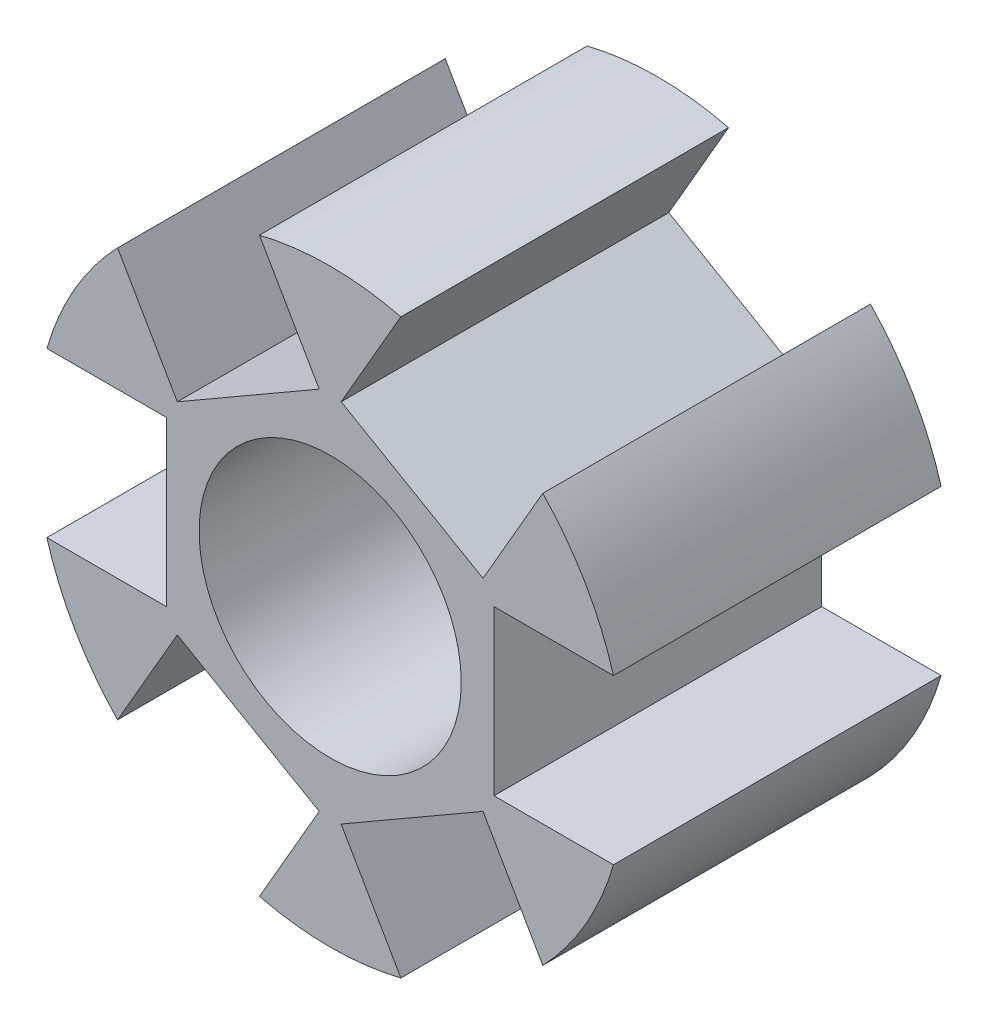
ISO-10303-21;
HEADER;
FILE_DESCRIPTION(('STEP AP214'),'2;1');
FILE_NAME('part.step','',(''),(''),'','','');
FILE_SCHEMA(('AUTOMOTIVE_DESIGN { 1 0 10303 214 1 1 1 1 }'));
ENDSEC;
DATA;
#1=APPLICATION_CONTEXT('core data for automotive mechanical design processes');
#2=APPLICATION_PROTOCOL_DEFINITION('international standard','automotive_design',2000,#1);
#3=PRODUCT_CONTEXT('',#1,'mechanical');
#4=PRODUCT('Part','Part','',(#3));
#5=PRODUCT_RELATED_PRODUCT_CATEGORY('part','',(#4));
#6=PRODUCT_DEFINITION_FORMATION('','',#4);
#7=PRODUCT_DEFINITION_CONTEXT('part definition',#1,'design');
#8=PRODUCT_DEFINITION('design','',#6,#7);
#9=PRODUCT_DEFINITION_SHAPE('','',#8);
#10=(LENGTH_UNIT() NAMED_UNIT(*) SI_UNIT(.MILLI.,.METRE.));
#11=(NAMED_UNIT(*) PLANE_ANGLE_UNIT() SI_UNIT($,.RADIAN.));
#12=(NAMED_UNIT(*) SI_UNIT($,.STERADIAN.) SOLID_ANGLE_UNIT());
#13=UNCERTAINTY_MEASURE_WITH_UNIT(LENGTH_MEASURE(1.E-05),#10,'distance_accuracy_value','');
#14=(GEOMETRIC_REPRESENTATION_CONTEXT(3) GLOBAL_UNCERTAINTY_ASSIGNED_CONTEXT((#13)) GLOBAL_UNIT_ASSIGNED_CONTEXT((#10,
#11,#12)) REPRESENTATION_CONTEXT('',''));
#15=CARTESIAN_POINT('',(0.,0.,0.));
#16=DIRECTION('',(0.,0.,1.));
#17=DIRECTION('',(1.,0.,0.));
#18=AXIS2_PLACEMENT_3D('',#15,#16,#17);
#19=CARTESIAN_POINT('',(0.,0.,5.));
#20=DIRECTION('',(0.,0.,1.));
#21=DIRECTION('',(1.,0.,0.));
#22=AXIS2_PLACEMENT_3D('',#19,#20,#21);
#23=PLANE('',#22);
#24=CARTESIAN_POINT('',(0.,0.,5.));
#25=DIRECTION('',(0.,0.,1.));
#26=DIRECTION('',(1.,0.,0.));
#27=AXIS2_PLACEMENT_3D('',#24,#25,#26);
#28=CIRCLE('',#27,4.);
#29=CARTESIAN_POINT('',(4.,0.,5.));
#30=VERTEX_POINT('',#29);
#31=EDGE_CURVE('E337',#30,#30,#28,.T.);
#32=ORIENTED_EDGE('',*,*,#31,.F.);
#33=EDGE_LOOP('',(#32));
#34=FACE_BOUND('',#33,.T.);
#35=DIRECTION('',(-0.866025403784433,-0.50000000000001,0.));
#36=VECTOR('',#35,1.);
#37=CARTESIAN_POINT('',(-0.334936490538965,5.58012701892219,5.));
#38=LINE('',#37,#36);
#39=CARTESIAN_POINT('',(-0.334936490538965,5.58012701892219,5.));
#40=VERTEX_POINT('',#39);
#41=CARTESIAN_POINT('',(-4.66506350946113,3.08012701892214,5.));
#42=VERTEX_POINT('',#41);
#43=EDGE_CURVE('E283',#40,#42,#38,.T.);
#44=ORIENTED_EDGE('',*,*,#43,.T.);
#45=DIRECTION('',(-0.50000000000001,0.866025403784433,0.));
#46=VECTOR('',#45,1.);
#47=CARTESIAN_POINT('',(-4.66506350946113,3.08012701892214,5.));
#48=LINE('',#47,#46);
#49=CARTESIAN_POINT('',(-6.48796762590881,6.23748956593589,5.));
#50=VERTEX_POINT('',#49);
#51=EDGE_CURVE('E287',#42,#50,#48,.T.);
#52=ORIENTED_EDGE('',*,*,#51,.T.);
#53=CARTESIAN_POINT('',(0.,0.,5.));
#54=DIRECTION('',(0.,0.,1.));
#55=DIRECTION('',(1.,0.,0.));
#56=AXIS2_PLACEMENT_3D('',#53,#54,#55);
#57=CIRCLE('',#56,9.);
#58=CARTESIAN_POINT('',(-8.64580823289529,2.5,5.));
#59=VERTEX_POINT('',#58);
#60=EDGE_CURVE('E350',#50,#59,#57,.T.);
#61=ORIENTED_EDGE('',*,*,#60,.T.);
#62=DIRECTION('',(-1.,0.,0.));
#63=VECTOR('',#62,1.);
#64=CARTESIAN_POINT('',(-5.,2.5,5.));
#65=LINE('',#64,#63);
#66=CARTESIAN_POINT('',(-5.,2.5,5.));
#67=VERTEX_POINT('',#66);
#68=EDGE_CURVE('E330',#67,#59,#65,.T.);
#69=ORIENTED_EDGE('',*,*,#68,.F.);
#70=DIRECTION('',(0.,-1.,0.));
#71=VECTOR('',#70,1.);
#72=CARTESIAN_POINT('',(-5.,2.5,5.));
#73=LINE('',#72,#71);
#74=CARTESIAN_POINT('',(-5.,-2.5,5.));
#75=VERTEX_POINT('',#74);
#76=EDGE_CURVE('E321',#67,#75,#73,.T.);
#77=ORIENTED_EDGE('',*,*,#76,.T.);
#78=DIRECTION('',(-1.,0.,0.));
#79=VECTOR('',#78,1.);
#80=CARTESIAN_POINT('',(-5.,-2.5,5.));
#81=LINE('',#80,#79);
#82=CARTESIAN_POINT('',(-8.64580823289529,-2.5,5.));
#83=VERTEX_POINT('',#82);
#84=EDGE_CURVE('E323',#75,#83,#81,.T.);
#85=ORIENTED_EDGE('',*,*,#84,.T.);
#86=CARTESIAN_POINT('',(-6.48796762590873,-6.23748956593598,5.));
#87=VERTEX_POINT('',#86);
#88=EDGE_CURVE('E342',#83,#87,#57,.T.);
#89=ORIENTED_EDGE('',*,*,#88,.T.);
#90=DIRECTION('',(-0.499999999999998,-0.86602540378444,0.));
#91=VECTOR('',#90,1.);
#92=CARTESIAN_POINT('',(-4.66506350946109,-3.0801270189222,5.));
#93=LINE('',#92,#91);
#94=CARTESIAN_POINT('',(-4.66506350946109,-3.0801270189222,5.));
#95=VERTEX_POINT('',#94);
#96=EDGE_CURVE('E306',#95,#87,#93,.T.);
#97=ORIENTED_EDGE('',*,*,#96,.F.);
#98=DIRECTION('',(0.86602540378444,-0.499999999999998,0.));
#99=VECTOR('',#98,1.);
#100=CARTESIAN_POINT('',(-4.66506350946109,-3.0801270189222,5.));
#101=LINE('',#100,#99);
#102=CARTESIAN_POINT('',(-0.334936490538889,-5.58012701892219,5.));
#103=VERTEX_POINT('',#102);
#104=EDGE_CURVE('E297',#95,#103,#101,.T.);
#105=ORIENTED_EDGE('',*,*,#104,.T.);
#106=DIRECTION('',(-0.499999999999998,-0.86602540378444,0.));
#107=VECTOR('',#106,1.);
#108=CARTESIAN_POINT('',(-0.334936490538889,-5.58012701892219,5.));
#109=LINE('',#108,#107);
#110=CARTESIAN_POINT('',(-2.15784060698653,-8.73748956593597,5.));
#111=VERTEX_POINT('',#110);
#112=EDGE_CURVE('E303',#103,#111,#109,.T.);
#113=ORIENTED_EDGE('',*,*,#112,.T.);
#114=CARTESIAN_POINT('',(2.15784060698659,-8.73748956593596,5.));
#115=VERTEX_POINT('',#114);
#116=EDGE_CURVE('E347',#111,#115,#57,.T.);
#117=ORIENTED_EDGE('',*,*,#116,.T.);
#118=DIRECTION('',(0.500000000000004,-0.866025403784436,0.));
#119=VECTOR('',#118,1.);
#120=CARTESIAN_POINT('',(0.334936490538926,-5.58012701892219,5.));
#121=LINE('',#120,#119);
#122=CARTESIAN_POINT('',(0.334936490538926,-5.58012701892219,5.));
#123=VERTEX_POINT('',#122);
#124=EDGE_CURVE('E231',#123,#115,#121,.T.);
#125=ORIENTED_EDGE('',*,*,#124,.F.);
#126=DIRECTION('',(0.866025403784436,0.500000000000004,0.));
#127=VECTOR('',#126,1.);
#128=CARTESIAN_POINT('',(0.334936490538926,-5.58012701892219,5.));
#129=LINE('',#128,#127);
#130=CARTESIAN_POINT('',(4.66506350946111,-3.08012701892217,5.));
#131=VERTEX_POINT('',#130);
#132=EDGE_CURVE('E516',#123,#131,#129,.T.);
#133=ORIENTED_EDGE('',*,*,#132,.T.);
#134=DIRECTION('',(0.500000000000004,-0.866025403784436,0.));
#135=VECTOR('',#134,1.);
#136=CARTESIAN_POINT('',(4.66506350946111,-3.08012701892217,5.));
#137=LINE('',#136,#135);
#138=CARTESIAN_POINT('',(6.48796762590877,-6.23748956593594,5.));
#139=VERTEX_POINT('',#138);
#140=EDGE_CURVE('E219',#131,#139,#137,.T.);
#141=ORIENTED_EDGE('',*,*,#140,.T.);
#142=CARTESIAN_POINT('',(8.64580823289529,-2.5,5.));
#143=VERTEX_POINT('',#142);
#144=EDGE_CURVE('E430',#139,#143,#57,.T.);
#145=ORIENTED_EDGE('',*,*,#144,.T.);
#146=DIRECTION('',(1.,0.,0.));
#147=VECTOR('',#146,1.);
#148=CARTESIAN_POINT('',(5.,-2.5,5.));
#149=LINE('',#148,#147);
#150=CARTESIAN_POINT('',(5.,-2.5,5.));
#151=VERTEX_POINT('',#150);
#152=EDGE_CURVE('E255',#151,#143,#149,.T.);
#153=ORIENTED_EDGE('',*,*,#152,.F.);
#154=DIRECTION('',(0.,1.,0.));
#155=VECTOR('',#154,1.);
#156=CARTESIAN_POINT('',(5.,-2.5,5.));
#157=LINE('',#156,#155);
#158=CARTESIAN_POINT('',(5.,2.5,5.));
#159=VERTEX_POINT('',#158);
#160=EDGE_CURVE('E246',#151,#159,#157,.T.);
#161=ORIENTED_EDGE('',*,*,#160,.T.);
#162=DIRECTION('',(1.,0.,0.));
#163=VECTOR('',#162,1.);
#164=CARTESIAN_POINT('',(5.,2.5,5.));
#165=LINE('',#164,#163);
#166=CARTESIAN_POINT('',(8.64580823289529,2.5,5.));
#167=VERTEX_POINT('',#166);
#168=EDGE_CURVE('E248',#159,#167,#165,.T.);
#169=ORIENTED_EDGE('',*,*,#168,.T.);
#170=CARTESIAN_POINT('',(6.48796762590869,6.23748956593603,5.));
#171=VERTEX_POINT('',#170);
#172=EDGE_CURVE('E429',#167,#171,#57,.T.);
#173=ORIENTED_EDGE('',*,*,#172,.T.);
#174=DIRECTION('',(0.499999999999992,0.866025403784443,0.));
#175=VECTOR('',#174,1.);
#176=CARTESIAN_POINT('',(4.66506350946107,3.08012701892223,5.));
#177=LINE('',#176,#175);
#178=CARTESIAN_POINT('',(4.66506350946107,3.08012701892223,5.));
#179=VERTEX_POINT('',#178);
#180=EDGE_CURVE('E63',#179,#171,#177,.T.);
#181=ORIENTED_EDGE('',*,*,#180,.F.);
#182=DIRECTION('',(-0.866025403784443,0.499999999999992,0.));
#183=VECTOR('',#182,1.);
#184=CARTESIAN_POINT('',(4.66506350946107,3.08012701892223,5.));
#185=LINE('',#184,#183);
#186=CARTESIAN_POINT('',(0.33493649053885,5.58012701892219,5.));
#187=VERTEX_POINT('',#186);
#188=EDGE_CURVE('E266',#179,#187,#185,.T.);
#189=ORIENTED_EDGE('',*,*,#188,.T.);
#190=DIRECTION('',(0.499999999999992,0.866025403784443,0.));
#191=VECTOR('',#190,1.);
#192=CARTESIAN_POINT('',(0.33493649053885,5.58012701892219,5.));
#193=LINE('',#192,#191);
#194=CARTESIAN_POINT('',(2.15784060698647,8.73748956593599,5.));
#195=VERTEX_POINT('',#194);
#196=EDGE_CURVE('E268',#187,#195,#193,.T.);
#197=ORIENTED_EDGE('',*,*,#196,.T.);
#198=CARTESIAN_POINT('',(-2.15784060698665,8.73748956593594,5.));
#199=VERTEX_POINT('',#198);
#200=EDGE_CURVE('E433',#195,#199,#57,.T.);
#201=ORIENTED_EDGE('',*,*,#200,.T.);
#202=DIRECTION('',(-0.50000000000001,0.866025403784433,0.));
#203=VECTOR('',#202,1.);
#204=CARTESIAN_POINT('',(-0.334936490538965,5.58012701892219,5.));
#205=LINE('',#204,#203);
#206=EDGE_CURVE('E57',#40,#199,#205,.T.);
#207=ORIENTED_EDGE('',*,*,#206,.F.);
#208=EDGE_LOOP('',(#44,#52,#61,#69,#77,#85,#89,#97,#105,#113,#117,#125,#133,#141,#145,#153,#161,
#169,#173,#181,#189,#197,#201,#207));
#209=FACE_BOUND('',#208,.T.);
#210=ADVANCED_FACE('F41',(#34,#209),#23,.T.);
#211=CARTESIAN_POINT('',(0.,0.,-5.));
#212=DIRECTION('',(0.,0.,1.));
#213=DIRECTION('',(1.,0.,0.));
#214=AXIS2_PLACEMENT_3D('',#211,#212,#213);
#215=PLANE('',#214);
#216=CARTESIAN_POINT('',(0.,0.,-5.));
#217=DIRECTION('',(0.,0.,1.));
#218=DIRECTION('',(1.,0.,0.));
#219=AXIS2_PLACEMENT_3D('',#216,#217,#218);
#220=CIRCLE('',#219,4.);
#221=CARTESIAN_POINT('',(4.,0.,-5.));
#222=VERTEX_POINT('',#221);
#223=EDGE_CURVE('E334',#222,#222,#220,.T.);
#224=ORIENTED_EDGE('',*,*,#223,.T.);
#225=EDGE_LOOP('',(#224));
#226=FACE_BOUND('',#225,.T.);
#227=DIRECTION('',(-0.50000000000001,0.866025403784433,0.));
#228=VECTOR('',#227,1.);
#229=CARTESIAN_POINT('',(-4.66506350946113,3.08012701892214,-5.));
#230=LINE('',#229,#228);
#231=CARTESIAN_POINT('',(-4.66506350946113,3.08012701892214,-5.));
#232=VERTEX_POINT('',#231);
#233=CARTESIAN_POINT('',(-6.48796762590881,6.23748956593589,-5.));
#234=VERTEX_POINT('',#233);
#235=EDGE_CURVE('E262',#232,#234,#230,.T.);
#236=ORIENTED_EDGE('',*,*,#235,.F.);
#237=DIRECTION('',(0.866025403784433,0.50000000000001,0.));
#238=VECTOR('',#237,1.);
#239=CARTESIAN_POINT('',(-0.334936490538965,5.58012701892219,-5.));
#240=LINE('',#239,#238);
#241=CARTESIAN_POINT('',(-0.334936490538965,5.58012701892219,-5.));
#242=VERTEX_POINT('',#241);
#243=EDGE_CURVE('E280',#232,#242,#240,.T.);
#244=ORIENTED_EDGE('',*,*,#243,.T.);
#245=DIRECTION('',(-0.50000000000001,0.866025403784433,0.));
#246=VECTOR('',#245,1.);
#247=CARTESIAN_POINT('',(-0.334936490538965,5.58012701892219,-5.));
#248=LINE('',#247,#246);
#249=CARTESIAN_POINT('',(-2.15784060698665,8.73748956593594,-5.));
#250=VERTEX_POINT('',#249);
#251=EDGE_CURVE('E292',#242,#250,#248,.T.);
#252=ORIENTED_EDGE('',*,*,#251,.T.);
#253=CARTESIAN_POINT('',(0.,0.,-5.));
#254=DIRECTION('',(0.,0.,1.));
#255=DIRECTION('',(1.,0.,0.));
#256=AXIS2_PLACEMENT_3D('',#253,#254,#255);
#257=CIRCLE('',#256,9.);
#258=CARTESIAN_POINT('',(2.15784060698647,8.73748956593599,-5.));
#259=VERTEX_POINT('',#258);
#260=EDGE_CURVE('E378',#259,#250,#257,.T.);
#261=ORIENTED_EDGE('',*,*,#260,.F.);
#262=DIRECTION('',(0.499999999999992,0.866025403784443,0.));
#263=VECTOR('',#262,1.);
#264=CARTESIAN_POINT('',(0.33493649053885,5.58012701892219,-5.));
#265=LINE('',#264,#263);
#266=CARTESIAN_POINT('',(0.33493649053885,5.58012701892219,-5.));
#267=VERTEX_POINT('',#266);
#268=EDGE_CURVE('E241',#267,#259,#265,.T.);
#269=ORIENTED_EDGE('',*,*,#268,.F.);
#270=DIRECTION('',(0.866025403784443,-0.499999999999992,0.));
#271=VECTOR('',#270,1.);
#272=CARTESIAN_POINT('',(4.66506350946107,3.08012701892223,-5.));
#273=LINE('',#272,#271);
#274=CARTESIAN_POINT('',(4.66506350946107,3.08012701892223,-5.));
#275=VERTEX_POINT('',#274);
#276=EDGE_CURVE('E260',#267,#275,#273,.T.);
#277=ORIENTED_EDGE('',*,*,#276,.T.);
#278=DIRECTION('',(0.499999999999992,0.866025403784443,0.));
#279=VECTOR('',#278,1.);
#280=CARTESIAN_POINT('',(4.66506350946107,3.08012701892223,-5.));
#281=LINE('',#280,#279);
#282=CARTESIAN_POINT('',(6.48796762590869,6.23748956593603,-5.));
#283=VERTEX_POINT('',#282);
#284=EDGE_CURVE('E271',#275,#283,#281,.T.);
#285=ORIENTED_EDGE('',*,*,#284,.T.);
#286=CARTESIAN_POINT('',(8.64580823289529,2.5,-5.));
#287=VERTEX_POINT('',#286);
#288=EDGE_CURVE('E385',#287,#283,#257,.T.);
#289=ORIENTED_EDGE('',*,*,#288,.F.);
#290=DIRECTION('',(1.,0.,0.));
#291=VECTOR('',#290,1.);
#292=CARTESIAN_POINT('',(5.,2.5,-5.));
#293=LINE('',#292,#291);
#294=CARTESIAN_POINT('',(5.,2.5,-5.));
#295=VERTEX_POINT('',#294);
#296=EDGE_CURVE('E216',#295,#287,#293,.T.);
#297=ORIENTED_EDGE('',*,*,#296,.F.);
#298=DIRECTION('',(0.,-1.,0.));
#299=VECTOR('',#298,1.);
#300=CARTESIAN_POINT('',(5.,-2.5,-5.));
#301=LINE('',#300,#299);
#302=CARTESIAN_POINT('',(5.,-2.5,-5.));
#303=VERTEX_POINT('',#302);
#304=EDGE_CURVE('E239',#295,#303,#301,.T.);
#305=ORIENTED_EDGE('',*,*,#304,.T.);
#306=DIRECTION('',(1.,0.,0.));
#307=VECTOR('',#306,1.);
#308=CARTESIAN_POINT('',(5.,-2.5,-5.));
#309=LINE('',#308,#307);
#310=CARTESIAN_POINT('',(8.64580823289529,-2.5,-5.));
#311=VERTEX_POINT('',#310);
#312=EDGE_CURVE('E251',#303,#311,#309,.T.);
#313=ORIENTED_EDGE('',*,*,#312,.T.);
#314=CARTESIAN_POINT('',(6.48796762590877,-6.23748956593594,-5.));
#315=VERTEX_POINT('',#314);
#316=EDGE_CURVE('E228',#315,#311,#257,.T.);
#317=ORIENTED_EDGE('',*,*,#316,.F.);
#318=DIRECTION('',(0.500000000000004,-0.866025403784436,0.));
#319=VECTOR('',#318,1.);
#320=CARTESIAN_POINT('',(4.66506350946111,-3.08012701892217,-5.));
#321=LINE('',#320,#319);
#322=CARTESIAN_POINT('',(4.66506350946111,-3.08012701892217,-5.));
#323=VERTEX_POINT('',#322);
#324=EDGE_CURVE('E215',#323,#315,#321,.T.);
#325=ORIENTED_EDGE('',*,*,#324,.F.);
#326=DIRECTION('',(-0.866025403784436,-0.500000000000004,0.));
#327=VECTOR('',#326,1.);
#328=CARTESIAN_POINT('',(0.334936490538926,-5.58012701892219,-5.));
#329=LINE('',#328,#327);
#330=CARTESIAN_POINT('',(0.334936490538926,-5.58012701892219,-5.));
#331=VERTEX_POINT('',#330);
#332=EDGE_CURVE('E205',#323,#331,#329,.T.);
#333=ORIENTED_EDGE('',*,*,#332,.T.);
#334=DIRECTION('',(0.500000000000004,-0.866025403784436,0.));
#335=VECTOR('',#334,1.);
#336=CARTESIAN_POINT('',(0.334936490538926,-5.58012701892219,-5.));
#337=LINE('',#336,#335);
#338=CARTESIAN_POINT('',(2.15784060698659,-8.73748956593596,-5.));
#339=VERTEX_POINT('',#338);
#340=EDGE_CURVE('E226',#331,#339,#337,.T.);
#341=ORIENTED_EDGE('',*,*,#340,.T.);
#342=CARTESIAN_POINT('',(-2.15784060698653,-8.73748956593597,-5.));
#343=VERTEX_POINT('',#342);
#344=EDGE_CURVE('E351',#343,#339,#257,.T.);
#345=ORIENTED_EDGE('',*,*,#344,.F.);
#346=DIRECTION('',(-0.499999999999998,-0.86602540378444,0.));
#347=VECTOR('',#346,1.);
#348=CARTESIAN_POINT('',(-0.334936490538889,-5.58012701892219,-5.));
#349=LINE('',#348,#347);
#350=CARTESIAN_POINT('',(-0.334936490538889,-5.58012701892219,-5.));
#351=VERTEX_POINT('',#350);
#352=EDGE_CURVE('E311',#351,#343,#349,.T.);
#353=ORIENTED_EDGE('',*,*,#352,.F.);
#354=DIRECTION('',(-0.86602540378444,0.499999999999998,0.));
#355=VECTOR('',#354,1.);
#356=CARTESIAN_POINT('',(-4.66506350946109,-3.0801270189222,-5.));
#357=LINE('',#356,#355);
#358=CARTESIAN_POINT('',(-4.66506350946109,-3.0801270189222,-5.));
#359=VERTEX_POINT('',#358);
#360=EDGE_CURVE('E233',#351,#359,#357,.T.);
#361=ORIENTED_EDGE('',*,*,#360,.T.);
#362=DIRECTION('',(-0.499999999999998,-0.86602540378444,0.));
#363=VECTOR('',#362,1.);
#364=CARTESIAN_POINT('',(-4.66506350946109,-3.0801270189222,-5.));
#365=LINE('',#364,#363);
#366=CARTESIAN_POINT('',(-6.48796762590873,-6.23748956593598,-5.));
#367=VERTEX_POINT('',#366);
#368=EDGE_CURVE('E308',#359,#367,#365,.T.);
#369=ORIENTED_EDGE('',*,*,#368,.T.);
#370=CARTESIAN_POINT('',(-8.64580823289529,-2.5,-5.));
#371=VERTEX_POINT('',#370);
#372=EDGE_CURVE('E349',#371,#367,#257,.T.);
#373=ORIENTED_EDGE('',*,*,#372,.F.);
#374=DIRECTION('',(-1.,0.,0.));
#375=VECTOR('',#374,1.);
#376=CARTESIAN_POINT('',(-5.,-2.5,-5.));
#377=LINE('',#376,#375);
#378=CARTESIAN_POINT('',(-5.,-2.5,-5.));
#379=VERTEX_POINT('',#378);
#380=EDGE_CURVE('E332',#379,#371,#377,.T.);
#381=ORIENTED_EDGE('',*,*,#380,.F.);
#382=DIRECTION('',(0.,1.,0.));
#383=VECTOR('',#382,1.);
#384=CARTESIAN_POINT('',(-5.,2.5,-5.));
#385=LINE('',#384,#383);
#386=CARTESIAN_POINT('',(-5.,2.5,-5.));
#387=VERTEX_POINT('',#386);
#388=EDGE_CURVE('E317',#379,#387,#385,.T.);
#389=ORIENTED_EDGE('',*,*,#388,.T.);
#390=DIRECTION('',(-1.,0.,0.));
#391=VECTOR('',#390,1.);
#392=CARTESIAN_POINT('',(-5.,2.5,-5.));
#393=LINE('',#392,#391);
#394=CARTESIAN_POINT('',(-8.64580823289529,2.5,-5.));
#395=VERTEX_POINT('',#394);
#396=EDGE_CURVE('E328',#387,#395,#393,.T.);
#397=ORIENTED_EDGE('',*,*,#396,.T.);
#398=EDGE_CURVE('E339',#234,#395,#257,.T.);
#399=ORIENTED_EDGE('',*,*,#398,.F.);
#400=EDGE_LOOP('',(#236,#244,#252,#261,#269,#277,#285,#289,#297,#305,#313,#317,#325,#333,#341,
#345,#353,#361,#369,#373,#381,#389,#397,#399));
#401=FACE_BOUND('',#400,.T.);
#402=ADVANCED_FACE('F222',(#226,#401),#215,.F.);
#403=CARTESIAN_POINT('',(0.,0.,5.));
#404=DIRECTION('',(0.,0.,-1.));
#405=DIRECTION('',(-1.,0.,0.));
#406=AXIS2_PLACEMENT_3D('',#403,#404,#405);
#407=CYLINDRICAL_SURFACE('',#406,9.);
#408=DIRECTION('',(0.,0.,-1.));
#409=VECTOR('',#408,1.);
#410=CARTESIAN_POINT('',(-6.48796762590881,6.23748956593589,5.));
#411=LINE('',#410,#409);
#412=EDGE_CURVE('E11',#234,#50,#411,.F.);
#413=ORIENTED_EDGE('',*,*,#412,.F.);
#414=ORIENTED_EDGE('',*,*,#398,.T.);
#415=DIRECTION('',(0.,0.,-1.));
#416=VECTOR('',#415,1.);
#417=CARTESIAN_POINT('',(-8.64580823289529,2.5,5.));
#418=LINE('',#417,#416);
#419=EDGE_CURVE('E345',#59,#395,#418,.T.);
#420=ORIENTED_EDGE('',*,*,#419,.F.);
#421=ORIENTED_EDGE('',*,*,#60,.F.);
#422=EDGE_LOOP('',(#413,#414,#420,#421));
#423=FACE_BOUND('',#422,.T.);
#424=ADVANCED_FACE('F43',(#423),#407,.T.);
#425=DIRECTION('',(0.,0.,-1.));
#426=VECTOR('',#425,1.);
#427=CARTESIAN_POINT('',(-2.15784060698665,8.73748956593594,5.));
#428=LINE('',#427,#426);
#429=EDGE_CURVE('E47',#199,#250,#428,.T.);
#430=ORIENTED_EDGE('',*,*,#429,.F.);
#431=ORIENTED_EDGE('',*,*,#200,.F.);
#432=DIRECTION('',(0.,0.,-1.));
#433=VECTOR('',#432,1.);
#434=CARTESIAN_POINT('',(2.15784060698647,8.73748956593599,5.));
#435=LINE('',#434,#433);
#436=EDGE_CURVE('E369',#259,#195,#435,.F.);
#437=ORIENTED_EDGE('',*,*,#436,.F.);
#438=ORIENTED_EDGE('',*,*,#260,.T.);
#439=EDGE_LOOP('',(#430,#431,#437,#438));
#440=FACE_BOUND('',#439,.T.);
#441=ADVANCED_FACE('F382',(#440),#407,.T.);
#442=DIRECTION('',(0.,0.,-1.));
#443=VECTOR('',#442,1.);
#444=CARTESIAN_POINT('',(6.48796762590869,6.23748956593603,5.));
#445=LINE('',#444,#443);
#446=EDGE_CURVE('E368',#171,#283,#445,.T.);
#447=ORIENTED_EDGE('',*,*,#446,.F.);
#448=ORIENTED_EDGE('',*,*,#172,.F.);
#449=DIRECTION('',(0.,0.,-1.));
#450=VECTOR('',#449,1.);
#451=CARTESIAN_POINT('',(8.64580823289529,2.5,5.));
#452=LINE('',#451,#450);
#453=EDGE_CURVE('E366',#287,#167,#452,.F.);
#454=ORIENTED_EDGE('',*,*,#453,.F.);
#455=ORIENTED_EDGE('',*,*,#288,.T.);
#456=EDGE_LOOP('',(#447,#448,#454,#455));
#457=FACE_BOUND('',#456,.T.);
#458=ADVANCED_FACE('F504',(#457),#407,.T.);
#459=DIRECTION('',(0.,0.,-1.));
#460=VECTOR('',#459,1.);
#461=CARTESIAN_POINT('',(8.64580823289529,-2.5,5.));
#462=LINE('',#461,#460);
#463=EDGE_CURVE('E364',#143,#311,#462,.T.);
#464=ORIENTED_EDGE('',*,*,#463,.F.);
#465=ORIENTED_EDGE('',*,*,#144,.F.);
#466=DIRECTION('',(0.,0.,-1.));
#467=VECTOR('',#466,1.);
#468=CARTESIAN_POINT('',(6.48796762590877,-6.23748956593594,5.));
#469=LINE('',#468,#467);
#470=EDGE_CURVE('E365',#315,#139,#469,.F.);
#471=ORIENTED_EDGE('',*,*,#470,.F.);
#472=ORIENTED_EDGE('',*,*,#316,.T.);
#473=EDGE_LOOP('',(#464,#465,#471,#472));
#474=FACE_BOUND('',#473,.T.);
#475=ADVANCED_FACE('F514',(#474),#407,.T.);
#476=DIRECTION('',(0.,0.,-1.));
#477=VECTOR('',#476,1.);
#478=CARTESIAN_POINT('',(2.15784060698659,-8.73748956593596,5.));
#479=LINE('',#478,#477);
#480=EDGE_CURVE('E359',#115,#339,#479,.T.);
#481=ORIENTED_EDGE('',*,*,#480,.F.);
#482=ORIENTED_EDGE('',*,*,#116,.F.);
#483=DIRECTION('',(0.,0.,-1.));
#484=VECTOR('',#483,1.);
#485=CARTESIAN_POINT('',(-2.15784060698653,-8.73748956593597,5.));
#486=LINE('',#485,#484);
#487=EDGE_CURVE('E356',#343,#111,#486,.F.);
#488=ORIENTED_EDGE('',*,*,#487,.F.);
#489=ORIENTED_EDGE('',*,*,#344,.T.);
#490=EDGE_LOOP('',(#481,#482,#488,#489));
#491=FACE_BOUND('',#490,.T.);
#492=ADVANCED_FACE('F424',(#491),#407,.T.);
#493=DIRECTION('',(0.,0.,-1.));
#494=VECTOR('',#493,1.);
#495=CARTESIAN_POINT('',(-6.48796762590873,-6.23748956593598,5.));
#496=LINE('',#495,#494);
#497=EDGE_CURVE('E358',#87,#367,#496,.T.);
#498=ORIENTED_EDGE('',*,*,#497,.F.);
#499=ORIENTED_EDGE('',*,*,#88,.F.);
#500=DIRECTION('',(0.,0.,-1.));
#501=VECTOR('',#500,1.);
#502=CARTESIAN_POINT('',(-8.64580823289529,-2.5,5.));
#503=LINE('',#502,#501);
#504=EDGE_CURVE('E353',#371,#83,#503,.F.);
#505=ORIENTED_EDGE('',*,*,#504,.F.);
#506=ORIENTED_EDGE('',*,*,#372,.T.);
#507=EDGE_LOOP('',(#498,#499,#505,#506));
#508=FACE_BOUND('',#507,.T.);
#509=ADVANCED_FACE('F407',(#508),#407,.T.);
#510=CARTESIAN_POINT('',(0.,0.,5.));
#511=DIRECTION('',(0.,0.,-1.));
#512=DIRECTION('',(-1.,0.,0.));
#513=AXIS2_PLACEMENT_3D('',#510,#511,#512);
#514=CYLINDRICAL_SURFACE('',#513,4.);
#515=ORIENTED_EDGE('',*,*,#31,.T.);
#516=EDGE_LOOP('',(#515));
#517=FACE_BOUND('',#516,.T.);
#518=ORIENTED_EDGE('',*,*,#223,.F.);
#519=EDGE_LOOP('',(#518));
#520=FACE_BOUND('',#519,.T.);
#521=ADVANCED_FACE('F459',(#517,#520),#514,.F.);
#522=CARTESIAN_POINT('',(-5.,-2.5,5.));
#523=DIRECTION('',(0.,1.,0.));
#524=DIRECTION('',(0.,0.,1.));
#525=AXIS2_PLACEMENT_3D('',#522,#523,#524);
#526=PLANE('',#525);
#527=ORIENTED_EDGE('',*,*,#504,.T.);
#528=ORIENTED_EDGE('',*,*,#84,.F.);
#529=DIRECTION('',(0.,0.,-1.));
#530=VECTOR('',#529,1.);
#531=CARTESIAN_POINT('',(-5.,-2.5,5.));
#532=LINE('',#531,#530);
#533=EDGE_CURVE('E312',#75,#379,#532,.T.);
#534=ORIENTED_EDGE('',*,*,#533,.T.);
#535=ORIENTED_EDGE('',*,*,#380,.T.);
#536=EDGE_LOOP('',(#527,#528,#534,#535));
#537=FACE_BOUND('',#536,.T.);
#538=ADVANCED_FACE('F399',(#537),#526,.T.);
#539=CARTESIAN_POINT('',(-5.,2.5,5.));
#540=DIRECTION('',(0.,-1.,0.));
#541=DIRECTION('',(0.,0.,-1.));
#542=AXIS2_PLACEMENT_3D('',#539,#540,#541);
#543=PLANE('',#542);
#544=ORIENTED_EDGE('',*,*,#419,.T.);
#545=ORIENTED_EDGE('',*,*,#396,.F.);
#546=DIRECTION('',(0.,0.,1.));
#547=VECTOR('',#546,1.);
#548=CARTESIAN_POINT('',(-5.,2.5,5.));
#549=LINE('',#548,#547);
#550=EDGE_CURVE('E316',#387,#67,#549,.T.);
#551=ORIENTED_EDGE('',*,*,#550,.T.);
#552=ORIENTED_EDGE('',*,*,#68,.T.);
#553=EDGE_LOOP('',(#544,#545,#551,#552));
#554=FACE_BOUND('',#553,.T.);
#555=ADVANCED_FACE('F390',(#554),#543,.T.);
#556=CARTESIAN_POINT('',(-5.,0.,0.));
#557=DIRECTION('',(-1.,0.,0.));
#558=DIRECTION('',(0.,0.,1.));
#559=AXIS2_PLACEMENT_3D('',#556,#557,#558);
#560=PLANE('',#559);
#561=ORIENTED_EDGE('',*,*,#533,.F.);
#562=ORIENTED_EDGE('',*,*,#76,.F.);
#563=ORIENTED_EDGE('',*,*,#550,.F.);
#564=ORIENTED_EDGE('',*,*,#388,.F.);
#565=EDGE_LOOP('',(#561,#562,#563,#564));
#566=FACE_BOUND('',#565,.T.);
#567=ADVANCED_FACE('F400',(#566),#560,.T.);
#568=CARTESIAN_POINT('',(-0.334936490538889,-5.58012701892219,5.));
#569=DIRECTION('',(-0.86602540378444,0.499999999999998,0.));
#570=DIRECTION('',(-0.499999999999998,-0.86602540378444,0.));
#571=AXIS2_PLACEMENT_3D('',#568,#569,#570);
#572=PLANE('',#571);
#573=ORIENTED_EDGE('',*,*,#487,.T.);
#574=ORIENTED_EDGE('',*,*,#112,.F.);
#575=DIRECTION('',(0.,0.,-1.));
#576=VECTOR('',#575,1.);
#577=CARTESIAN_POINT('',(-0.334936490538889,-5.58012701892219,5.));
#578=LINE('',#577,#576);
#579=EDGE_CURVE('E227',#103,#351,#578,.T.);
#580=ORIENTED_EDGE('',*,*,#579,.T.);
#581=ORIENTED_EDGE('',*,*,#352,.T.);
#582=EDGE_LOOP('',(#573,#574,#580,#581));
#583=FACE_BOUND('',#582,.T.);
#584=ADVANCED_FACE('F417',(#583),#572,.T.);
#585=CARTESIAN_POINT('',(-4.66506350946109,-3.0801270189222,5.));
#586=DIRECTION('',(0.86602540378444,-0.499999999999998,0.));
#587=DIRECTION('',(0.499999999999998,0.86602540378444,0.));
#588=AXIS2_PLACEMENT_3D('',#585,#586,#587);
#589=PLANE('',#588);
#590=ORIENTED_EDGE('',*,*,#497,.T.);
#591=ORIENTED_EDGE('',*,*,#368,.F.);
#592=DIRECTION('',(0.,0.,1.));
#593=VECTOR('',#592,1.);
#594=CARTESIAN_POINT('',(-4.66506350946109,-3.0801270189222,5.));
#595=LINE('',#594,#593);
#596=EDGE_CURVE('E296',#359,#95,#595,.T.);
#597=ORIENTED_EDGE('',*,*,#596,.T.);
#598=ORIENTED_EDGE('',*,*,#96,.T.);
#599=EDGE_LOOP('',(#590,#591,#597,#598));
#600=FACE_BOUND('',#599,.T.);
#601=ADVANCED_FACE('F408',(#600),#589,.T.);
#602=CARTESIAN_POINT('',(-2.49999999999999,-4.3301270189222,0.));
#603=DIRECTION('',(-0.499999999999998,-0.86602540378444,0.));
#604=DIRECTION('',(0.,0.,1.));
#605=AXIS2_PLACEMENT_3D('',#602,#603,#604);
#606=PLANE('',#605);
#607=ORIENTED_EDGE('',*,*,#579,.F.);
#608=ORIENTED_EDGE('',*,*,#104,.F.);
#609=ORIENTED_EDGE('',*,*,#596,.F.);
#610=ORIENTED_EDGE('',*,*,#360,.F.);
#611=EDGE_LOOP('',(#607,#608,#609,#610));
#612=FACE_BOUND('',#611,.T.);
#613=ADVANCED_FACE('F413',(#612),#606,.T.);
#614=CARTESIAN_POINT('',(4.66506350946111,-3.08012701892217,5.));
#615=DIRECTION('',(-0.866025403784436,-0.500000000000004,0.));
#616=DIRECTION('',(0.500000000000004,-0.866025403784436,0.));
#617=AXIS2_PLACEMENT_3D('',#614,#615,#616);
#618=PLANE('',#617);
#619=ORIENTED_EDGE('',*,*,#470,.T.);
#620=ORIENTED_EDGE('',*,*,#140,.F.);
#621=DIRECTION('',(0.,0.,-1.));
#622=VECTOR('',#621,1.);
#623=CARTESIAN_POINT('',(4.66506350946111,-3.08012701892217,5.));
#624=LINE('',#623,#622);
#625=EDGE_CURVE('E207',#131,#323,#624,.T.);
#626=ORIENTED_EDGE('',*,*,#625,.T.);
#627=ORIENTED_EDGE('',*,*,#324,.T.);
#628=EDGE_LOOP('',(#619,#620,#626,#627));
#629=FACE_BOUND('',#628,.T.);
#630=ADVANCED_FACE('F213',(#629),#618,.T.);
#631=CARTESIAN_POINT('',(0.334936490538926,-5.58012701892219,5.));
#632=DIRECTION('',(0.866025403784436,0.500000000000004,0.));
#633=DIRECTION('',(-0.500000000000004,0.866025403784436,0.));
#634=AXIS2_PLACEMENT_3D('',#631,#632,#633);
#635=PLANE('',#634);
#636=ORIENTED_EDGE('',*,*,#480,.T.);
#637=ORIENTED_EDGE('',*,*,#340,.F.);
#638=DIRECTION('',(0.,0.,1.));
#639=VECTOR('',#638,1.);
#640=CARTESIAN_POINT('',(0.334936490538926,-5.58012701892219,5.));
#641=LINE('',#640,#639);
#642=EDGE_CURVE('E206',#331,#123,#641,.T.);
#643=ORIENTED_EDGE('',*,*,#642,.T.);
#644=ORIENTED_EDGE('',*,*,#124,.T.);
#645=EDGE_LOOP('',(#636,#637,#643,#644));
#646=FACE_BOUND('',#645,.T.);
#647=ADVANCED_FACE('F513',(#646),#635,.T.);
#648=CARTESIAN_POINT('',(2.50000000000002,-4.33012701892218,0.));
#649=DIRECTION('',(0.500000000000004,-0.866025403784436,0.));
#650=DIRECTION('',(0.,0.,1.));
#651=AXIS2_PLACEMENT_3D('',#648,#649,#650);
#652=PLANE('',#651);
#653=ORIENTED_EDGE('',*,*,#625,.F.);
#654=ORIENTED_EDGE('',*,*,#132,.F.);
#655=ORIENTED_EDGE('',*,*,#642,.F.);
#656=ORIENTED_EDGE('',*,*,#332,.F.);
#657=EDGE_LOOP('',(#653,#654,#655,#656));
#658=FACE_BOUND('',#657,.T.);
#659=ADVANCED_FACE('F203',(#658),#652,.T.);
#660=CARTESIAN_POINT('',(5.,2.5,5.));
#661=DIRECTION('',(0.,-1.,0.));
#662=DIRECTION('',(0.,0.,-1.));
#663=AXIS2_PLACEMENT_3D('',#660,#661,#662);
#664=PLANE('',#663);
#665=ORIENTED_EDGE('',*,*,#453,.T.);
#666=ORIENTED_EDGE('',*,*,#168,.F.);
#667=DIRECTION('',(0.,0.,-1.));
#668=VECTOR('',#667,1.);
#669=CARTESIAN_POINT('',(5.,2.5,5.));
#670=LINE('',#669,#668);
#671=EDGE_CURVE('E240',#159,#295,#670,.T.);
#672=ORIENTED_EDGE('',*,*,#671,.T.);
#673=ORIENTED_EDGE('',*,*,#296,.T.);
#674=EDGE_LOOP('',(#665,#666,#672,#673));
#675=FACE_BOUND('',#674,.T.);
#676=ADVANCED_FACE('F486',(#675),#664,.T.);
#677=CARTESIAN_POINT('',(5.,-2.5,5.));
#678=DIRECTION('',(0.,1.,0.));
#679=DIRECTION('',(0.,0.,1.));
#680=AXIS2_PLACEMENT_3D('',#677,#678,#679);
#681=PLANE('',#680);
#682=ORIENTED_EDGE('',*,*,#463,.T.);
#683=ORIENTED_EDGE('',*,*,#312,.F.);
#684=DIRECTION('',(0.,0.,1.));
#685=VECTOR('',#684,1.);
#686=CARTESIAN_POINT('',(5.,-2.5,5.));
#687=LINE('',#686,#685);
#688=EDGE_CURVE('E242',#303,#151,#687,.T.);
#689=ORIENTED_EDGE('',*,*,#688,.T.);
#690=ORIENTED_EDGE('',*,*,#152,.T.);
#691=EDGE_LOOP('',(#682,#683,#689,#690));
#692=FACE_BOUND('',#691,.T.);
#693=ADVANCED_FACE('F496',(#692),#681,.T.);
#694=CARTESIAN_POINT('',(5.,0.,0.));
#695=DIRECTION('',(1.,0.,0.));
#696=DIRECTION('',(0.,0.,1.));
#697=AXIS2_PLACEMENT_3D('',#694,#695,#696);
#698=PLANE('',#697);
#699=ORIENTED_EDGE('',*,*,#671,.F.);
#700=ORIENTED_EDGE('',*,*,#160,.F.);
#701=ORIENTED_EDGE('',*,*,#688,.F.);
#702=ORIENTED_EDGE('',*,*,#304,.F.);
#703=EDGE_LOOP('',(#699,#700,#701,#702));
#704=FACE_BOUND('',#703,.T.);
#705=ADVANCED_FACE('F493',(#704),#698,.T.);
#706=CARTESIAN_POINT('',(0.33493649053885,5.58012701892219,5.));
#707=DIRECTION('',(0.866025403784443,-0.499999999999992,0.));
#708=DIRECTION('',(0.499999999999992,0.866025403784443,0.));
#709=AXIS2_PLACEMENT_3D('',#706,#707,#708);
#710=PLANE('',#709);
#711=ORIENTED_EDGE('',*,*,#436,.T.);
#712=ORIENTED_EDGE('',*,*,#196,.F.);
#713=DIRECTION('',(0.,0.,-1.));
#714=VECTOR('',#713,1.);
#715=CARTESIAN_POINT('',(0.33493649053885,5.58012701892219,5.));
#716=LINE('',#715,#714);
#717=EDGE_CURVE('E257',#187,#267,#716,.T.);
#718=ORIENTED_EDGE('',*,*,#717,.T.);
#719=ORIENTED_EDGE('',*,*,#268,.T.);
#720=EDGE_LOOP('',(#711,#712,#718,#719));
#721=FACE_BOUND('',#720,.T.);
#722=ADVANCED_FACE('F483',(#721),#710,.T.);
#723=CARTESIAN_POINT('',(4.66506350946107,3.08012701892223,5.));
#724=DIRECTION('',(-0.866025403784443,0.499999999999992,0.));
#725=DIRECTION('',(-0.499999999999992,-0.866025403784443,0.));
#726=AXIS2_PLACEMENT_3D('',#723,#724,#725);
#727=PLANE('',#726);
#728=ORIENTED_EDGE('',*,*,#446,.T.);
#729=ORIENTED_EDGE('',*,*,#284,.F.);
#730=DIRECTION('',(0.,0.,1.));
#731=VECTOR('',#730,1.);
#732=CARTESIAN_POINT('',(4.66506350946107,3.08012701892223,5.));
#733=LINE('',#732,#731);
#734=EDGE_CURVE('E261',#275,#179,#733,.T.);
#735=ORIENTED_EDGE('',*,*,#734,.T.);
#736=ORIENTED_EDGE('',*,*,#180,.T.);
#737=EDGE_LOOP('',(#728,#729,#735,#736));
#738=FACE_BOUND('',#737,.T.);
#739=ADVANCED_FACE('F479',(#738),#727,.T.);
#740=CARTESIAN_POINT('',(2.49999999999996,4.33012701892221,0.));
#741=DIRECTION('',(0.499999999999992,0.866025403784443,0.));
#742=DIRECTION('',(0.,0.,1.));
#743=AXIS2_PLACEMENT_3D('',#740,#741,#742);
#744=PLANE('',#743);
#745=ORIENTED_EDGE('',*,*,#717,.F.);
#746=ORIENTED_EDGE('',*,*,#188,.F.);
#747=ORIENTED_EDGE('',*,*,#734,.F.);
#748=ORIENTED_EDGE('',*,*,#276,.F.);
#749=EDGE_LOOP('',(#745,#746,#747,#748));
#750=FACE_BOUND('',#749,.T.);
#751=ADVANCED_FACE('F473',(#750),#744,.T.);
#752=CARTESIAN_POINT('',(-4.66506350946113,3.08012701892214,5.));
#753=DIRECTION('',(0.866025403784433,0.50000000000001,0.));
#754=DIRECTION('',(-0.50000000000001,0.866025403784433,0.));
#755=AXIS2_PLACEMENT_3D('',#752,#753,#754);
#756=PLANE('',#755);
#757=ORIENTED_EDGE('',*,*,#412,.T.);
#758=ORIENTED_EDGE('',*,*,#51,.F.);
#759=DIRECTION('',(0.,0.,-1.));
#760=VECTOR('',#759,1.);
#761=CARTESIAN_POINT('',(-4.66506350946113,3.08012701892214,5.));
#762=LINE('',#761,#760);
#763=EDGE_CURVE('E277',#42,#232,#762,.T.);
#764=ORIENTED_EDGE('',*,*,#763,.T.);
#765=ORIENTED_EDGE('',*,*,#235,.T.);
#766=EDGE_LOOP('',(#757,#758,#764,#765));
#767=FACE_BOUND('',#766,.T.);
#768=ADVANCED_FACE('F438',(#767),#756,.T.);
#769=CARTESIAN_POINT('',(-0.334936490538965,5.58012701892219,5.));
#770=DIRECTION('',(-0.866025403784433,-0.50000000000001,0.));
#771=DIRECTION('',(0.50000000000001,-0.866025403784433,0.));
#772=AXIS2_PLACEMENT_3D('',#769,#770,#771);
#773=PLANE('',#772);
#774=ORIENTED_EDGE('',*,*,#429,.T.);
#775=ORIENTED_EDGE('',*,*,#251,.F.);
#776=DIRECTION('',(0.,0.,1.));
#777=VECTOR('',#776,1.);
#778=CARTESIAN_POINT('',(-0.334936490538965,5.58012701892219,5.));
#779=LINE('',#778,#777);
#780=EDGE_CURVE('E284',#242,#40,#779,.T.);
#781=ORIENTED_EDGE('',*,*,#780,.T.);
#782=ORIENTED_EDGE('',*,*,#206,.T.);
#783=EDGE_LOOP('',(#774,#775,#781,#782));
#784=FACE_BOUND('',#783,.T.);
#785=ADVANCED_FACE('F371',(#784),#773,.T.);
#786=CARTESIAN_POINT('',(-2.50000000000005,4.33012701892216,0.));
#787=DIRECTION('',(-0.50000000000001,0.866025403784433,0.));
#788=DIRECTION('',(0.,0.,1.));
#789=AXIS2_PLACEMENT_3D('',#786,#787,#788);
#790=PLANE('',#789);
#791=ORIENTED_EDGE('',*,*,#763,.F.);
#792=ORIENTED_EDGE('',*,*,#43,.F.);
#793=ORIENTED_EDGE('',*,*,#780,.F.);
#794=ORIENTED_EDGE('',*,*,#243,.F.);
#795=EDGE_LOOP('',(#791,#792,#793,#794));
#796=FACE_BOUND('',#795,.T.);
#797=ADVANCED_FACE('F439',(#796),#790,.T.);
#798=CLOSED_SHELL('',(#210,#402,#424,#441,#458,#475,#492,#509,#521,#538,#555,#567,#584,#601,
#613,#630,#647,#659,#676,#693,#705,#722,#739,#751,#768,#785,#797));
#799=MANIFOLD_SOLID_BREP('B2',#798);
#800=ADVANCED_BREP_SHAPE_REPRESENTATION('',(#18,#799),#14);
#801=SHAPE_DEFINITION_REPRESENTATION(#9,#800);
ENDSEC;
END-ISO-10303-21;
